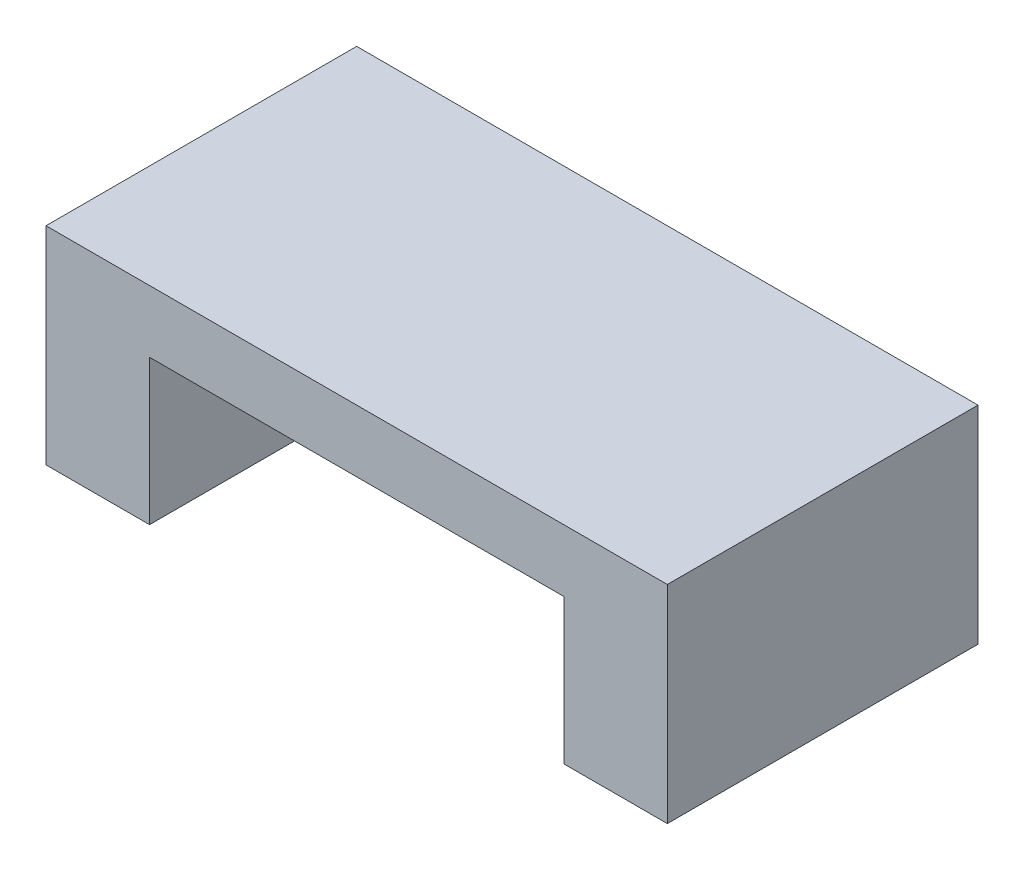
ISO-10303-21;
HEADER;
FILE_DESCRIPTION(('STEP AP214'),'2;1');
FILE_NAME('part.step','',(''),(''),'','','');
FILE_SCHEMA(('AUTOMOTIVE_DESIGN { 1 0 10303 214 1 1 1 1 }'));
ENDSEC;
DATA;
#1=APPLICATION_CONTEXT('core data for automotive mechanical design processes');
#2=APPLICATION_PROTOCOL_DEFINITION('international standard','automotive_design',2000,#1);
#3=PRODUCT_CONTEXT('',#1,'mechanical');
#4=PRODUCT('Part','Part','',(#3));
#5=PRODUCT_RELATED_PRODUCT_CATEGORY('part','',(#4));
#6=PRODUCT_DEFINITION_FORMATION('','',#4);
#7=PRODUCT_DEFINITION_CONTEXT('part definition',#1,'design');
#8=PRODUCT_DEFINITION('design','',#6,#7);
#9=PRODUCT_DEFINITION_SHAPE('','',#8);
#10=(LENGTH_UNIT() NAMED_UNIT(*) SI_UNIT(.MILLI.,.METRE.));
#11=(NAMED_UNIT(*) PLANE_ANGLE_UNIT() SI_UNIT($,.RADIAN.));
#12=(NAMED_UNIT(*) SI_UNIT($,.STERADIAN.) SOLID_ANGLE_UNIT());
#13=UNCERTAINTY_MEASURE_WITH_UNIT(LENGTH_MEASURE(1.E-05),#10,'distance_accuracy_value','');
#14=(GEOMETRIC_REPRESENTATION_CONTEXT(3) GLOBAL_UNCERTAINTY_ASSIGNED_CONTEXT((#13)) GLOBAL_UNIT_ASSIGNED_CONTEXT((#10,
#11,#12)) REPRESENTATION_CONTEXT('',''));
#15=CARTESIAN_POINT('',(0.,0.,0.));
#16=DIRECTION('',(0.,0.,1.));
#17=DIRECTION('',(1.,0.,0.));
#18=AXIS2_PLACEMENT_3D('',#15,#16,#17);
#19=CARTESIAN_POINT('',(0.,0.,0.));
#20=DIRECTION('',(0.,-1.,0.));
#21=DIRECTION('',(0.,0.,-1.));
#22=AXIS2_PLACEMENT_3D('',#19,#20,#21);
#23=PLANE('',#22);
#24=CARTESIAN_POINT('',(-12.5,0.,0.));
#25=DIRECTION('',(0.,-1.,0.));
#26=DIRECTION('',(0.,0.,-1.));
#27=AXIS2_PLACEMENT_3D('',#24,#25,#26);
#28=CIRCLE('',#27,1.5);
#29=CARTESIAN_POINT('',(-12.5,0.,-1.5));
#30=VERTEX_POINT('',#29);
#31=EDGE_CURVE('E197',#30,#30,#28,.T.);
#32=ORIENTED_EDGE('',*,*,#31,.F.);
#33=EDGE_LOOP('',(#32));
#34=FACE_BOUND('',#33,.T.);
#35=DIRECTION('',(0.,0.,1.));
#36=VECTOR('',#35,1.);
#37=CARTESIAN_POINT('',(-10.,0.,-7.5));
#38=LINE('',#37,#36);
#39=CARTESIAN_POINT('',(-10.,0.,-7.5));
#40=VERTEX_POINT('',#39);
#41=CARTESIAN_POINT('',(-10.,0.,7.5));
#42=VERTEX_POINT('',#41);
#43=EDGE_CURVE('E114',#40,#42,#38,.T.);
#44=ORIENTED_EDGE('',*,*,#43,.T.);
#45=DIRECTION('',(1.,0.,0.));
#46=VECTOR('',#45,1.);
#47=CARTESIAN_POINT('',(-15.,0.,7.5));
#48=LINE('',#47,#46);
#49=CARTESIAN_POINT('',(-15.,0.,7.5));
#50=VERTEX_POINT('',#49);
#51=EDGE_CURVE('E152',#50,#42,#48,.T.);
#52=ORIENTED_EDGE('',*,*,#51,.F.);
#53=DIRECTION('',(0.,0.,1.));
#54=VECTOR('',#53,1.);
#55=CARTESIAN_POINT('',(-15.,0.,7.5));
#56=LINE('',#55,#54);
#57=CARTESIAN_POINT('',(-15.,0.,-7.5));
#58=VERTEX_POINT('',#57);
#59=EDGE_CURVE('E137',#58,#50,#56,.T.);
#60=ORIENTED_EDGE('',*,*,#59,.F.);
#61=DIRECTION('',(-1.,0.,0.));
#62=VECTOR('',#61,1.);
#63=CARTESIAN_POINT('',(-15.,0.,-7.5));
#64=LINE('',#63,#62);
#65=EDGE_CURVE('E130',#40,#58,#64,.T.);
#66=ORIENTED_EDGE('',*,*,#65,.F.);
#67=EDGE_LOOP('',(#44,#52,#60,#66));
#68=FACE_BOUND('',#67,.T.);
#69=ADVANCED_FACE('F39',(#34,#68),#23,.T.);
#70=CARTESIAN_POINT('',(15.,10.,7.5));
#71=DIRECTION('',(-1.,0.,0.));
#72=DIRECTION('',(0.,0.,1.));
#73=AXIS2_PLACEMENT_3D('',#70,#71,#72);
#74=PLANE('',#73);
#75=DIRECTION('',(0.,0.,-1.));
#76=VECTOR('',#75,1.);
#77=CARTESIAN_POINT('',(15.,0.,7.5));
#78=LINE('',#77,#76);
#79=CARTESIAN_POINT('',(15.,0.,7.5));
#80=VERTEX_POINT('',#79);
#81=CARTESIAN_POINT('',(15.,0.,-7.5));
#82=VERTEX_POINT('',#81);
#83=EDGE_CURVE('E140',#80,#82,#78,.T.);
#84=ORIENTED_EDGE('',*,*,#83,.T.);
#85=DIRECTION('',(0.,-1.,0.));
#86=VECTOR('',#85,1.);
#87=CARTESIAN_POINT('',(15.,10.,-7.5));
#88=LINE('',#87,#86);
#89=CARTESIAN_POINT('',(15.,10.,-7.5));
#90=VERTEX_POINT('',#89);
#91=EDGE_CURVE('E11',#90,#82,#88,.T.);
#92=ORIENTED_EDGE('',*,*,#91,.F.);
#93=DIRECTION('',(0.,0.,-1.));
#94=VECTOR('',#93,1.);
#95=CARTESIAN_POINT('',(15.,10.,7.5));
#96=LINE('',#95,#94);
#97=CARTESIAN_POINT('',(15.,10.,7.5));
#98=VERTEX_POINT('',#97);
#99=EDGE_CURVE('E155',#98,#90,#96,.T.);
#100=ORIENTED_EDGE('',*,*,#99,.F.);
#101=DIRECTION('',(0.,-1.,0.));
#102=VECTOR('',#101,1.);
#103=CARTESIAN_POINT('',(15.,10.,7.5));
#104=LINE('',#103,#102);
#105=EDGE_CURVE('E156',#98,#80,#104,.T.);
#106=ORIENTED_EDGE('',*,*,#105,.T.);
#107=EDGE_LOOP('',(#84,#92,#100,#106));
#108=FACE_BOUND('',#107,.T.);
#109=ADVANCED_FACE('F41',(#108),#74,.F.);
#110=CARTESIAN_POINT('',(-15.,10.,-7.5));
#111=DIRECTION('',(0.,0.,1.));
#112=DIRECTION('',(1.,0.,0.));
#113=AXIS2_PLACEMENT_3D('',#110,#111,#112);
#114=PLANE('',#113);
#115=DIRECTION('',(-1.,0.,0.));
#116=VECTOR('',#115,1.);
#117=CARTESIAN_POINT('',(-10.,7.,-7.5));
#118=LINE('',#117,#116);
#119=CARTESIAN_POINT('',(9.99999999999999,7.,-7.5));
#120=VERTEX_POINT('',#119);
#121=CARTESIAN_POINT('',(-10.,7.,-7.5));
#122=VERTEX_POINT('',#121);
#123=EDGE_CURVE('E127',#120,#122,#118,.T.);
#124=ORIENTED_EDGE('',*,*,#123,.T.);
#125=DIRECTION('',(0.,-1.,0.));
#126=VECTOR('',#125,1.);
#127=CARTESIAN_POINT('',(-10.,0.,-7.5));
#128=LINE('',#127,#126);
#129=EDGE_CURVE('E117',#122,#40,#128,.T.);
#130=ORIENTED_EDGE('',*,*,#129,.T.);
#131=ORIENTED_EDGE('',*,*,#65,.T.);
#132=DIRECTION('',(0.,-1.,0.));
#133=VECTOR('',#132,1.);
#134=CARTESIAN_POINT('',(-15.,10.,-7.5));
#135=LINE('',#134,#133);
#136=CARTESIAN_POINT('',(-15.,10.,-7.5));
#137=VERTEX_POINT('',#136);
#138=EDGE_CURVE('E48',#137,#58,#135,.T.);
#139=ORIENTED_EDGE('',*,*,#138,.F.);
#140=DIRECTION('',(-1.,0.,0.));
#141=VECTOR('',#140,1.);
#142=CARTESIAN_POINT('',(-15.,10.,-7.5));
#143=LINE('',#142,#141);
#144=EDGE_CURVE('E92',#90,#137,#143,.T.);
#145=ORIENTED_EDGE('',*,*,#144,.F.);
#146=ORIENTED_EDGE('',*,*,#91,.T.);
#147=CARTESIAN_POINT('',(9.99999999999999,0.,-7.5));
#148=VERTEX_POINT('',#147);
#149=EDGE_CURVE('E139',#82,#148,#64,.T.);
#150=ORIENTED_EDGE('',*,*,#149,.T.);
#151=DIRECTION('',(0.,1.,0.));
#152=VECTOR('',#151,1.);
#153=CARTESIAN_POINT('',(9.99999999999999,0.,-7.5));
#154=LINE('',#153,#152);
#155=EDGE_CURVE('E55',#148,#120,#154,.T.);
#156=ORIENTED_EDGE('',*,*,#155,.T.);
#157=EDGE_LOOP('',(#124,#130,#131,#139,#145,#146,#150,#156));
#158=FACE_BOUND('',#157,.T.);
#159=ADVANCED_FACE('F129',(#158),#114,.F.);
#160=CARTESIAN_POINT('',(-15.,10.,7.5));
#161=DIRECTION('',(1.,0.,0.));
#162=DIRECTION('',(0.,0.,-1.));
#163=AXIS2_PLACEMENT_3D('',#160,#161,#162);
#164=PLANE('',#163);
#165=ORIENTED_EDGE('',*,*,#59,.T.);
#166=DIRECTION('',(0.,-1.,0.));
#167=VECTOR('',#166,1.);
#168=CARTESIAN_POINT('',(-15.,10.,7.5));
#169=LINE('',#168,#167);
#170=CARTESIAN_POINT('',(-15.,10.,7.5));
#171=VERTEX_POINT('',#170);
#172=EDGE_CURVE('E159',#171,#50,#169,.T.);
#173=ORIENTED_EDGE('',*,*,#172,.F.);
#174=DIRECTION('',(0.,0.,1.));
#175=VECTOR('',#174,1.);
#176=CARTESIAN_POINT('',(-15.,10.,7.5));
#177=LINE('',#176,#175);
#178=EDGE_CURVE('E167',#137,#171,#177,.T.);
#179=ORIENTED_EDGE('',*,*,#178,.F.);
#180=ORIENTED_EDGE('',*,*,#138,.T.);
#181=EDGE_LOOP('',(#165,#173,#179,#180));
#182=FACE_BOUND('',#181,.T.);
#183=ADVANCED_FACE('F165',(#182),#164,.F.);
#184=CARTESIAN_POINT('',(-15.,10.,7.5));
#185=DIRECTION('',(0.,0.,-1.));
#186=DIRECTION('',(-1.,0.,0.));
#187=AXIS2_PLACEMENT_3D('',#184,#185,#186);
#188=PLANE('',#187);
#189=ORIENTED_EDGE('',*,*,#51,.T.);
#190=DIRECTION('',(0.,-1.,0.));
#191=VECTOR('',#190,1.);
#192=CARTESIAN_POINT('',(-10.,0.,7.5));
#193=LINE('',#192,#191);
#194=CARTESIAN_POINT('',(-10.,7.,7.5));
#195=VERTEX_POINT('',#194);
#196=EDGE_CURVE('E120',#195,#42,#193,.T.);
#197=ORIENTED_EDGE('',*,*,#196,.F.);
#198=DIRECTION('',(-1.,0.,0.));
#199=VECTOR('',#198,1.);
#200=CARTESIAN_POINT('',(-10.,7.,7.5));
#201=LINE('',#200,#199);
#202=CARTESIAN_POINT('',(9.99999999999999,7.,7.5));
#203=VERTEX_POINT('',#202);
#204=EDGE_CURVE('E134',#203,#195,#201,.T.);
#205=ORIENTED_EDGE('',*,*,#204,.F.);
#206=DIRECTION('',(0.,1.,0.));
#207=VECTOR('',#206,1.);
#208=CARTESIAN_POINT('',(9.99999999999999,0.,7.5));
#209=LINE('',#208,#207);
#210=CARTESIAN_POINT('',(9.99999999999999,0.,7.5));
#211=VERTEX_POINT('',#210);
#212=EDGE_CURVE('E186',#211,#203,#209,.T.);
#213=ORIENTED_EDGE('',*,*,#212,.F.);
#214=EDGE_CURVE('E85',#211,#80,#48,.T.);
#215=ORIENTED_EDGE('',*,*,#214,.T.);
#216=ORIENTED_EDGE('',*,*,#105,.F.);
#217=DIRECTION('',(1.,0.,0.));
#218=VECTOR('',#217,1.);
#219=CARTESIAN_POINT('',(-15.,10.,7.5));
#220=LINE('',#219,#218);
#221=EDGE_CURVE('E64',#171,#98,#220,.T.);
#222=ORIENTED_EDGE('',*,*,#221,.F.);
#223=ORIENTED_EDGE('',*,*,#172,.T.);
#224=EDGE_LOOP('',(#189,#197,#205,#213,#215,#216,#222,#223));
#225=FACE_BOUND('',#224,.T.);
#226=ADVANCED_FACE('F231',(#225),#188,.F.);
#227=CARTESIAN_POINT('',(0.,10.,0.));
#228=DIRECTION('',(0.,-1.,0.));
#229=DIRECTION('',(0.,0.,-1.));
#230=AXIS2_PLACEMENT_3D('',#227,#228,#229);
#231=PLANE('',#230);
#232=ORIENTED_EDGE('',*,*,#99,.T.);
#233=ORIENTED_EDGE('',*,*,#144,.T.);
#234=ORIENTED_EDGE('',*,*,#178,.T.);
#235=ORIENTED_EDGE('',*,*,#221,.T.);
#236=EDGE_LOOP('',(#232,#233,#234,#235));
#237=FACE_BOUND('',#236,.T.);
#238=ADVANCED_FACE('F225',(#237),#231,.F.);
#239=CARTESIAN_POINT('',(12.5,0.,0.));
#240=DIRECTION('',(0.,-1.,0.));
#241=DIRECTION('',(0.,0.,-1.));
#242=AXIS2_PLACEMENT_3D('',#239,#240,#241);
#243=CIRCLE('',#242,1.5);
#244=CARTESIAN_POINT('',(12.5,0.,-1.5));
#245=VERTEX_POINT('',#244);
#246=EDGE_CURVE('E205',#245,#245,#243,.T.);
#247=ORIENTED_EDGE('',*,*,#246,.F.);
#248=EDGE_LOOP('',(#247));
#249=FACE_BOUND('',#248,.T.);
#250=DIRECTION('',(0.,0.,1.));
#251=VECTOR('',#250,1.);
#252=CARTESIAN_POINT('',(9.99999999999999,0.,-7.5));
#253=LINE('',#252,#251);
#254=EDGE_CURVE('E126',#148,#211,#253,.T.);
#255=ORIENTED_EDGE('',*,*,#254,.F.);
#256=ORIENTED_EDGE('',*,*,#149,.F.);
#257=ORIENTED_EDGE('',*,*,#83,.F.);
#258=ORIENTED_EDGE('',*,*,#214,.F.);
#259=EDGE_LOOP('',(#255,#256,#257,#258));
#260=FACE_BOUND('',#259,.T.);
#261=ADVANCED_FACE('F222',(#249,#260),#23,.T.);
#262=CARTESIAN_POINT('',(-10.,0.,-7.5));
#263=DIRECTION('',(-1.,0.,0.));
#264=DIRECTION('',(0.,0.,1.));
#265=AXIS2_PLACEMENT_3D('',#262,#263,#264);
#266=PLANE('',#265);
#267=ORIENTED_EDGE('',*,*,#196,.T.);
#268=ORIENTED_EDGE('',*,*,#43,.F.);
#269=ORIENTED_EDGE('',*,*,#129,.F.);
#270=DIRECTION('',(0.,0.,1.));
#271=VECTOR('',#270,1.);
#272=CARTESIAN_POINT('',(-10.,7.,-7.5));
#273=LINE('',#272,#271);
#274=EDGE_CURVE('E146',#122,#195,#273,.T.);
#275=ORIENTED_EDGE('',*,*,#274,.T.);
#276=EDGE_LOOP('',(#267,#268,#269,#275));
#277=FACE_BOUND('',#276,.T.);
#278=ADVANCED_FACE('F116',(#277),#266,.F.);
#279=CARTESIAN_POINT('',(-10.,7.,-7.5));
#280=DIRECTION('',(0.,1.,0.));
#281=DIRECTION('',(0.,0.,1.));
#282=AXIS2_PLACEMENT_3D('',#279,#280,#281);
#283=PLANE('',#282);
#284=ORIENTED_EDGE('',*,*,#204,.T.);
#285=ORIENTED_EDGE('',*,*,#274,.F.);
#286=ORIENTED_EDGE('',*,*,#123,.F.);
#287=DIRECTION('',(0.,0.,1.));
#288=VECTOR('',#287,1.);
#289=CARTESIAN_POINT('',(9.99999999999999,7.,-7.5));
#290=LINE('',#289,#288);
#291=EDGE_CURVE('E178',#120,#203,#290,.T.);
#292=ORIENTED_EDGE('',*,*,#291,.T.);
#293=EDGE_LOOP('',(#284,#285,#286,#292));
#294=FACE_BOUND('',#293,.T.);
#295=ADVANCED_FACE('F234',(#294),#283,.F.);
#296=CARTESIAN_POINT('',(9.99999999999999,0.,-7.5));
#297=DIRECTION('',(1.,0.,0.));
#298=DIRECTION('',(0.,0.,-1.));
#299=AXIS2_PLACEMENT_3D('',#296,#297,#298);
#300=PLANE('',#299);
#301=ORIENTED_EDGE('',*,*,#212,.T.);
#302=ORIENTED_EDGE('',*,*,#291,.F.);
#303=ORIENTED_EDGE('',*,*,#155,.F.);
#304=ORIENTED_EDGE('',*,*,#254,.T.);
#305=EDGE_LOOP('',(#301,#302,#303,#304));
#306=FACE_BOUND('',#305,.T.);
#307=ADVANCED_FACE('F218',(#306),#300,.F.);
#308=CARTESIAN_POINT('',(12.5,5.,0.));
#309=DIRECTION('',(0.,-1.,0.));
#310=DIRECTION('',(0.,0.,-1.));
#311=AXIS2_PLACEMENT_3D('',#308,#309,#310);
#312=CYLINDRICAL_SURFACE('',#311,1.5);
#313=CARTESIAN_POINT('',(12.5,5.,0.));
#314=DIRECTION('',(0.,-1.,0.));
#315=DIRECTION('',(0.,0.,-1.));
#316=AXIS2_PLACEMENT_3D('',#313,#314,#315);
#317=CIRCLE('',#316,1.5);
#318=CARTESIAN_POINT('',(12.5,5.,-1.5));
#319=VERTEX_POINT('',#318);
#320=EDGE_CURVE('E192',#319,#319,#317,.T.);
#321=ORIENTED_EDGE('',*,*,#320,.F.);
#322=EDGE_LOOP('',(#321));
#323=FACE_BOUND('',#322,.T.);
#324=ORIENTED_EDGE('',*,*,#246,.T.);
#325=EDGE_LOOP('',(#324));
#326=FACE_BOUND('',#325,.T.);
#327=ADVANCED_FACE('F215',(#323,#326),#312,.F.);
#328=CARTESIAN_POINT('',(12.5,5.,0.));
#329=DIRECTION('',(0.,-1.,0.));
#330=DIRECTION('',(0.,0.,-1.));
#331=AXIS2_PLACEMENT_3D('',#328,#329,#330);
#332=PLANE('',#331);
#333=ORIENTED_EDGE('',*,*,#320,.T.);
#334=EDGE_LOOP('',(#333));
#335=FACE_BOUND('',#334,.T.);
#336=ADVANCED_FACE('F213',(#335),#332,.T.);
#337=CARTESIAN_POINT('',(-12.5,5.,0.));
#338=DIRECTION('',(0.,-1.,0.));
#339=DIRECTION('',(0.,0.,-1.));
#340=AXIS2_PLACEMENT_3D('',#337,#338,#339);
#341=CYLINDRICAL_SURFACE('',#340,1.5);
#342=CARTESIAN_POINT('',(-12.5,5.,0.));
#343=DIRECTION('',(0.,-1.,0.));
#344=DIRECTION('',(0.,0.,-1.));
#345=AXIS2_PLACEMENT_3D('',#342,#343,#344);
#346=CIRCLE('',#345,1.5);
#347=CARTESIAN_POINT('',(-12.5,5.,-1.5));
#348=VERTEX_POINT('',#347);
#349=EDGE_CURVE('E201',#348,#348,#346,.T.);
#350=ORIENTED_EDGE('',*,*,#349,.F.);
#351=EDGE_LOOP('',(#350));
#352=FACE_BOUND('',#351,.T.);
#353=ORIENTED_EDGE('',*,*,#31,.T.);
#354=EDGE_LOOP('',(#353));
#355=FACE_BOUND('',#354,.T.);
#356=ADVANCED_FACE('F323',(#352,#355),#341,.F.);
#357=CARTESIAN_POINT('',(-12.5,5.,0.));
#358=DIRECTION('',(0.,-1.,0.));
#359=DIRECTION('',(0.,0.,-1.));
#360=AXIS2_PLACEMENT_3D('',#357,#358,#359);
#361=PLANE('',#360);
#362=ORIENTED_EDGE('',*,*,#349,.T.);
#363=EDGE_LOOP('',(#362));
#364=FACE_BOUND('',#363,.T.);
#365=ADVANCED_FACE('F331',(#364),#361,.T.);
#366=CLOSED_SHELL('',(#69,#109,#159,#183,#226,#238,#261,#278,#295,#307,#327,#336,#356,#365));
#367=MANIFOLD_SOLID_BREP('B2',#366);
#368=ADVANCED_BREP_SHAPE_REPRESENTATION('',(#18,#367),#14);
#369=SHAPE_DEFINITION_REPRESENTATION(#9,#368);
ENDSEC;
END-ISO-10303-21;
